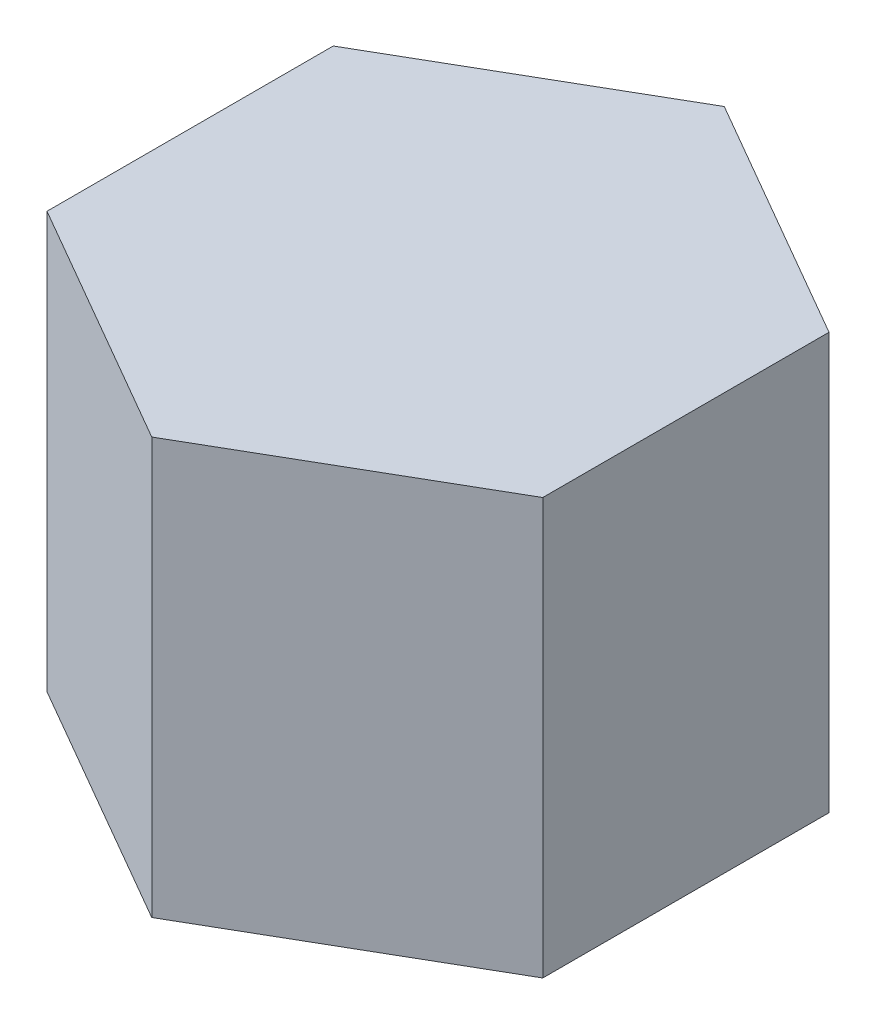
ISO-10303-21;
HEADER;
FILE_DESCRIPTION(('STEP AP214'),'2;1');
FILE_NAME('part.step','',(''),(''),'','','');
FILE_SCHEMA(('AUTOMOTIVE_DESIGN { 1 0 10303 214 1 1 1 1 }'));
ENDSEC;
DATA;
#1=APPLICATION_CONTEXT('core data for automotive mechanical design processes');
#2=APPLICATION_PROTOCOL_DEFINITION('international standard','automotive_design',2000,#1);
#3=PRODUCT_CONTEXT('',#1,'mechanical');
#4=PRODUCT('Part','Part','',(#3));
#5=PRODUCT_RELATED_PRODUCT_CATEGORY('part','',(#4));
#6=PRODUCT_DEFINITION_FORMATION('','',#4);
#7=PRODUCT_DEFINITION_CONTEXT('part definition',#1,'design');
#8=PRODUCT_DEFINITION('design','',#6,#7);
#9=PRODUCT_DEFINITION_SHAPE('','',#8);
#10=(LENGTH_UNIT() NAMED_UNIT(*) SI_UNIT(.MILLI.,.METRE.));
#11=(NAMED_UNIT(*) PLANE_ANGLE_UNIT() SI_UNIT($,.RADIAN.));
#12=(NAMED_UNIT(*) SI_UNIT($,.STERADIAN.) SOLID_ANGLE_UNIT());
#13=UNCERTAINTY_MEASURE_WITH_UNIT(LENGTH_MEASURE(1.E-05),#10,'distance_accuracy_value','');
#14=(GEOMETRIC_REPRESENTATION_CONTEXT(3) GLOBAL_UNCERTAINTY_ASSIGNED_CONTEXT((#13)) GLOBAL_UNIT_ASSIGNED_CONTEXT((#10,
#11,#12)) REPRESENTATION_CONTEXT('',''));
#15=CARTESIAN_POINT('',(0.,0.,0.));
#16=DIRECTION('',(0.,0.,1.));
#17=DIRECTION('',(1.,0.,0.));
#18=AXIS2_PLACEMENT_3D('',#15,#16,#17);
#19=CARTESIAN_POINT('',(209.839551417382,-147.556598747966,292.547996624279));
#20=DIRECTION('',(-0.500000000000028,0.,-0.866025403784422));
#21=DIRECTION('',(-0.866025403784423,0.,0.500000000000028));
#22=AXIS2_PLACEMENT_3D('',#19,#20,#21);
#23=PLANE('',#22);
#24=CARTESIAN_POINT('',(210.142660308706,-147.047793579175,292.372996624279));
#25=DIRECTION('',(-0.866025403784422,0.,0.500000000000028));
#26=VECTOR('',#25,1.);
#27=LINE('',#24,#26);
#28=CARTESIAN_POINT('',(210.142660308706,-147.047793579175,292.372996624279));
#29=VERTEX_POINT('',#28);
#30=CARTESIAN_POINT('',(209.839551417382,-147.047793579175,292.547996624279));
#31=VERTEX_POINT('',#30);
#32=EDGE_CURVE('E170',#29,#31,#27,.T.);
#33=ORIENTED_EDGE('',*,*,#32,.T.);
#34=CARTESIAN_POINT('',(209.839551417382,-147.556598747966,292.547996624279));
#35=DIRECTION('',(0.,1.,0.));
#36=VECTOR('',#35,1.);
#37=LINE('',#34,#36);
#38=CARTESIAN_POINT('',(209.839551417382,-147.556598747966,292.547996624279));
#39=VERTEX_POINT('',#38);
#40=EDGE_CURVE('E35',#39,#31,#37,.T.);
#41=ORIENTED_EDGE('',*,*,#40,.F.);
#42=CARTESIAN_POINT('',(210.142660308706,-147.556598747966,292.372996624279));
#43=DIRECTION('',(-0.866025403784422,0.,0.500000000000028));
#44=VECTOR('',#43,1.);
#45=LINE('',#42,#44);
#46=CARTESIAN_POINT('',(210.142660308706,-147.556598747966,292.372996624279));
#47=VERTEX_POINT('',#46);
#48=EDGE_CURVE('E159',#47,#39,#45,.T.);
#49=ORIENTED_EDGE('',*,*,#48,.F.);
#50=CARTESIAN_POINT('',(210.142660308706,-147.556598747966,292.372996624279));
#51=DIRECTION('',(0.,1.,0.));
#52=VECTOR('',#51,1.);
#53=LINE('',#50,#52);
#54=EDGE_CURVE('E10',#47,#29,#53,.T.);
#55=ORIENTED_EDGE('',*,*,#54,.T.);
#56=EDGE_LOOP('',(#33,#41,#49,#55));
#57=FACE_BOUND('',#56,.T.);
#58=ADVANCED_FACE('F16',(#57),#23,.F.);
#59=CARTESIAN_POINT('',(210.142660308706,-147.556598747966,291.594471220494));
#60=DIRECTION('',(-1.,0.,0.));
#61=DIRECTION('',(0.,-1.,0.));
#62=AXIS2_PLACEMENT_3D('',#59,#60,#61);
#63=PLANE('',#62);
#64=CARTESIAN_POINT('',(210.142660308706,-147.047793579175,292.022996624279));
#65=DIRECTION('',(0.,0.,1.));
#66=VECTOR('',#65,1.);
#67=LINE('',#64,#66);
#68=CARTESIAN_POINT('',(210.142660308706,-147.047793579175,292.022996624279));
#69=VERTEX_POINT('',#68);
#70=EDGE_CURVE('E167',#69,#29,#67,.T.);
#71=ORIENTED_EDGE('',*,*,#70,.T.);
#72=ORIENTED_EDGE('',*,*,#54,.F.);
#73=CARTESIAN_POINT('',(210.142660308706,-147.556598747966,292.022996624279));
#74=DIRECTION('',(0.,0.,1.));
#75=VECTOR('',#74,1.);
#76=LINE('',#73,#75);
#77=CARTESIAN_POINT('',(210.142660308706,-147.556598747966,292.022996624279));
#78=VERTEX_POINT('',#77);
#79=EDGE_CURVE('E156',#78,#47,#76,.T.);
#80=ORIENTED_EDGE('',*,*,#79,.F.);
#81=CARTESIAN_POINT('',(210.142660308706,-147.556598747966,292.022996624279));
#82=DIRECTION('',(0.,1.,0.));
#83=VECTOR('',#82,1.);
#84=LINE('',#81,#83);
#85=EDGE_CURVE('E27',#78,#69,#84,.T.);
#86=ORIENTED_EDGE('',*,*,#85,.T.);
#87=EDGE_LOOP('',(#71,#72,#80,#86));
#88=FACE_BOUND('',#87,.T.);
#89=ADVANCED_FACE('F189',(#88),#63,.F.);
#90=CARTESIAN_POINT('',(210.142660308706,-147.556598747966,292.022996624279));
#91=DIRECTION('',(-0.499999999999943,0.,0.866025403784471));
#92=DIRECTION('',(0.866025403784471,0.,0.499999999999943));
#93=AXIS2_PLACEMENT_3D('',#90,#91,#92);
#94=PLANE('',#93);
#95=CARTESIAN_POINT('',(209.839551417382,-147.047793579175,291.847996624279));
#96=DIRECTION('',(0.866025403784471,0.,0.499999999999943));
#97=VECTOR('',#96,1.);
#98=LINE('',#95,#97);
#99=CARTESIAN_POINT('',(209.839551417382,-147.047793579175,291.847996624279));
#100=VERTEX_POINT('',#99);
#101=EDGE_CURVE('E163',#100,#69,#98,.T.);
#102=ORIENTED_EDGE('',*,*,#101,.T.);
#103=ORIENTED_EDGE('',*,*,#85,.F.);
#104=CARTESIAN_POINT('',(209.839551417382,-147.556598747966,291.847996624279));
#105=DIRECTION('',(0.866025403784471,0.,0.499999999999943));
#106=VECTOR('',#105,1.);
#107=LINE('',#104,#106);
#108=CARTESIAN_POINT('',(209.839551417382,-147.556598747966,291.847996624279));
#109=VERTEX_POINT('',#108);
#110=EDGE_CURVE('E106',#109,#78,#107,.T.);
#111=ORIENTED_EDGE('',*,*,#110,.F.);
#112=CARTESIAN_POINT('',(209.839551417382,-147.556598747966,291.847996624279));
#113=DIRECTION('',(0.,1.,0.));
#114=VECTOR('',#113,1.);
#115=LINE('',#112,#114);
#116=EDGE_CURVE('E94',#109,#100,#115,.T.);
#117=ORIENTED_EDGE('',*,*,#116,.T.);
#118=EDGE_LOOP('',(#102,#103,#111,#117));
#119=FACE_BOUND('',#118,.T.);
#120=ADVANCED_FACE('F198',(#119),#94,.F.);
#121=CARTESIAN_POINT('',(209.839551417382,-147.556598747966,291.847996624279));
#122=DIRECTION('',(0.499999999999978,0.,0.866025403784452));
#123=DIRECTION('',(0.866025403784452,0.,-0.499999999999978));
#124=AXIS2_PLACEMENT_3D('',#121,#122,#123);
#125=PLANE('',#124);
#126=CARTESIAN_POINT('',(209.536442526057,-147.047793579175,292.022996624279));
#127=DIRECTION('',(0.866025403784452,0.,-0.499999999999978));
#128=VECTOR('',#127,1.);
#129=LINE('',#126,#128);
#130=CARTESIAN_POINT('',(209.536442526057,-147.047793579175,292.022996624279));
#131=VERTEX_POINT('',#130);
#132=EDGE_CURVE('E162',#131,#100,#129,.T.);
#133=ORIENTED_EDGE('',*,*,#132,.T.);
#134=ORIENTED_EDGE('',*,*,#116,.F.);
#135=CARTESIAN_POINT('',(209.536442526057,-147.556598747966,292.022996624279));
#136=DIRECTION('',(0.866025403784452,0.,-0.499999999999978));
#137=VECTOR('',#136,1.);
#138=LINE('',#135,#137);
#139=CARTESIAN_POINT('',(209.536442526057,-147.556598747966,292.022996624279));
#140=VERTEX_POINT('',#139);
#141=EDGE_CURVE('E98',#140,#109,#138,.T.);
#142=ORIENTED_EDGE('',*,*,#141,.F.);
#143=CARTESIAN_POINT('',(209.536442526057,-147.556598747966,292.022996624279));
#144=DIRECTION('',(0.,1.,0.));
#145=VECTOR('',#144,1.);
#146=LINE('',#143,#145);
#147=EDGE_CURVE('E79',#140,#131,#146,.T.);
#148=ORIENTED_EDGE('',*,*,#147,.T.);
#149=EDGE_LOOP('',(#133,#134,#142,#148));
#150=FACE_BOUND('',#149,.T.);
#151=ADVANCED_FACE('F100',(#150),#125,.F.);
#152=CARTESIAN_POINT('',(209.536442526057,-147.556598747966,291.594471220494));
#153=DIRECTION('',(1.,0.,0.));
#154=DIRECTION('',(0.,1.,0.));
#155=AXIS2_PLACEMENT_3D('',#152,#153,#154);
#156=PLANE('',#155);
#157=CARTESIAN_POINT('',(209.536442526057,-147.047793579175,292.372996624279));
#158=DIRECTION('',(0.,0.,-1.));
#159=VECTOR('',#158,1.);
#160=LINE('',#157,#159);
#161=CARTESIAN_POINT('',(209.536442526057,-147.047793579175,292.372996624279));
#162=VERTEX_POINT('',#161);
#163=EDGE_CURVE('E88',#162,#131,#160,.T.);
#164=ORIENTED_EDGE('',*,*,#163,.T.);
#165=ORIENTED_EDGE('',*,*,#147,.F.);
#166=CARTESIAN_POINT('',(209.536442526057,-147.556598747966,292.372996624279));
#167=DIRECTION('',(0.,0.,-1.));
#168=VECTOR('',#167,1.);
#169=LINE('',#166,#168);
#170=CARTESIAN_POINT('',(209.536442526057,-147.556598747966,292.372996624279));
#171=VERTEX_POINT('',#170);
#172=EDGE_CURVE('E84',#171,#140,#169,.T.);
#173=ORIENTED_EDGE('',*,*,#172,.F.);
#174=CARTESIAN_POINT('',(209.536442526057,-147.556598747966,292.372996624279));
#175=DIRECTION('',(0.,1.,0.));
#176=VECTOR('',#175,1.);
#177=LINE('',#174,#176);
#178=EDGE_CURVE('E58',#171,#162,#177,.T.);
#179=ORIENTED_EDGE('',*,*,#178,.T.);
#180=EDGE_LOOP('',(#164,#165,#173,#179));
#181=FACE_BOUND('',#180,.T.);
#182=ADVANCED_FACE('F82',(#181),#156,.F.);
#183=CARTESIAN_POINT('',(209.536442526057,-147.556598747966,292.372996624279));
#184=DIRECTION('',(0.499999999999978,0.,-0.866025403784452));
#185=DIRECTION('',(-0.866025403784452,0.,-0.499999999999978));
#186=AXIS2_PLACEMENT_3D('',#183,#184,#185);
#187=PLANE('',#186);
#188=CARTESIAN_POINT('',(209.839551417382,-147.047793579175,292.547996624279));
#189=DIRECTION('',(-0.866025403784452,0.,-0.499999999999978));
#190=VECTOR('',#189,1.);
#191=LINE('',#188,#190);
#192=EDGE_CURVE('E160',#31,#162,#191,.T.);
#193=ORIENTED_EDGE('',*,*,#192,.T.);
#194=ORIENTED_EDGE('',*,*,#178,.F.);
#195=CARTESIAN_POINT('',(209.839551417382,-147.556598747966,292.547996624279));
#196=DIRECTION('',(-0.866025403784452,0.,-0.499999999999978));
#197=VECTOR('',#196,1.);
#198=LINE('',#195,#197);
#199=EDGE_CURVE('E112',#39,#171,#198,.T.);
#200=ORIENTED_EDGE('',*,*,#199,.F.);
#201=ORIENTED_EDGE('',*,*,#40,.T.);
#202=EDGE_LOOP('',(#193,#194,#200,#201));
#203=FACE_BOUND('',#202,.T.);
#204=ADVANCED_FACE('F131',(#203),#187,.F.);
#205=CARTESIAN_POINT('',(206.491105863044,-147.556598747966,291.594471220494));
#206=DIRECTION('',(0.,1.,0.));
#207=DIRECTION('',(-1.,0.,0.));
#208=AXIS2_PLACEMENT_3D('',#205,#206,#207);
#209=PLANE('',#208);
#210=ORIENTED_EDGE('',*,*,#48,.T.);
#211=ORIENTED_EDGE('',*,*,#199,.T.);
#212=ORIENTED_EDGE('',*,*,#172,.T.);
#213=ORIENTED_EDGE('',*,*,#141,.T.);
#214=ORIENTED_EDGE('',*,*,#110,.T.);
#215=ORIENTED_EDGE('',*,*,#79,.T.);
#216=EDGE_LOOP('',(#210,#211,#212,#213,#214,#215));
#217=FACE_BOUND('',#216,.T.);
#218=ADVANCED_FACE('F111',(#217),#209,.F.);
#219=CARTESIAN_POINT('',(206.491105863044,-147.047793579175,291.594471220494));
#220=DIRECTION('',(0.,1.,0.));
#221=DIRECTION('',(-1.,0.,0.));
#222=AXIS2_PLACEMENT_3D('',#219,#220,#221);
#223=PLANE('',#222);
#224=ORIENTED_EDGE('',*,*,#32,.F.);
#225=ORIENTED_EDGE('',*,*,#70,.F.);
#226=ORIENTED_EDGE('',*,*,#101,.F.);
#227=ORIENTED_EDGE('',*,*,#132,.F.);
#228=ORIENTED_EDGE('',*,*,#163,.F.);
#229=ORIENTED_EDGE('',*,*,#192,.F.);
#230=EDGE_LOOP('',(#224,#225,#226,#227,#228,#229));
#231=FACE_BOUND('',#230,.T.);
#232=ADVANCED_FACE('F130',(#231),#223,.T.);
#233=CLOSED_SHELL('',(#58,#89,#120,#151,#182,#204,#218,#232));
#234=MANIFOLD_SOLID_BREP('B1',#233);
#235=ADVANCED_BREP_SHAPE_REPRESENTATION('',(#18,#234),#14);
#236=SHAPE_DEFINITION_REPRESENTATION(#9,#235);
ENDSEC;
END-ISO-10303-21;
